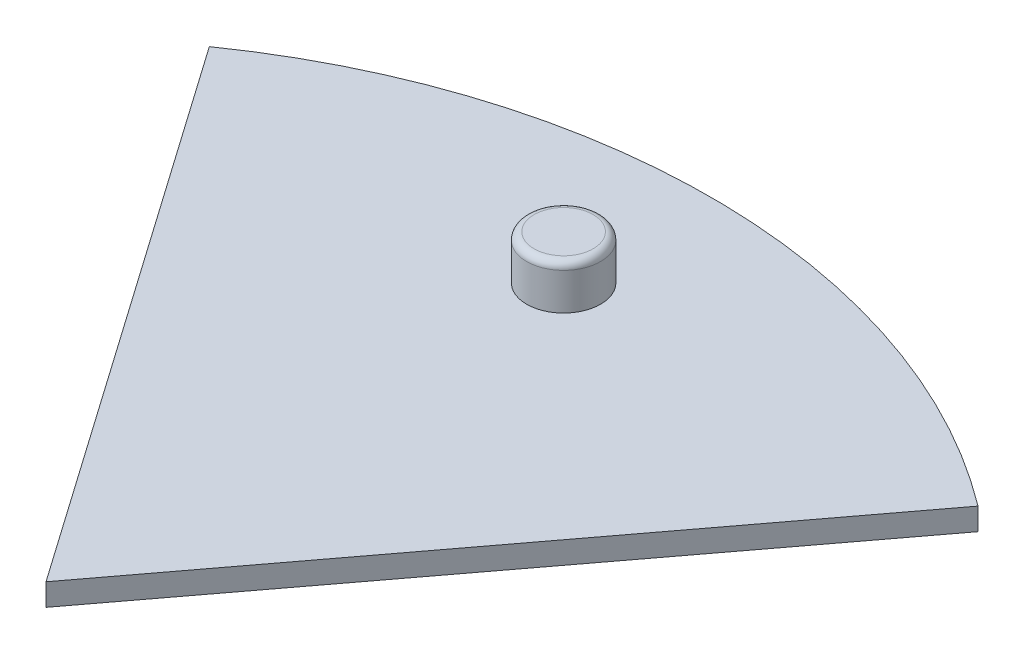
ISO-10303-21;
HEADER;
FILE_DESCRIPTION(('STEP AP214'),'2;1');
FILE_NAME('part.step','',(''),(''),'','','');
FILE_SCHEMA(('AUTOMOTIVE_DESIGN { 1 0 10303 214 1 1 1 1 }'));
ENDSEC;
DATA;
#1=APPLICATION_CONTEXT('core data for automotive mechanical design processes');
#2=APPLICATION_PROTOCOL_DEFINITION('international standard','automotive_design',2000,#1);
#3=PRODUCT_CONTEXT('',#1,'mechanical');
#4=PRODUCT('Part','Part','',(#3));
#5=PRODUCT_RELATED_PRODUCT_CATEGORY('part','',(#4));
#6=PRODUCT_DEFINITION_FORMATION('','',#4);
#7=PRODUCT_DEFINITION_CONTEXT('part definition',#1,'design');
#8=PRODUCT_DEFINITION('design','',#6,#7);
#9=PRODUCT_DEFINITION_SHAPE('','',#8);
#10=(LENGTH_UNIT() NAMED_UNIT(*) SI_UNIT(.MILLI.,.METRE.));
#11=(NAMED_UNIT(*) PLANE_ANGLE_UNIT() SI_UNIT($,.RADIAN.));
#12=(NAMED_UNIT(*) SI_UNIT($,.STERADIAN.) SOLID_ANGLE_UNIT());
#13=UNCERTAINTY_MEASURE_WITH_UNIT(LENGTH_MEASURE(1.E-05),#10,'distance_accuracy_value','');
#14=(GEOMETRIC_REPRESENTATION_CONTEXT(3) GLOBAL_UNCERTAINTY_ASSIGNED_CONTEXT((#13)) GLOBAL_UNIT_ASSIGNED_CONTEXT((#10,
#11,#12)) REPRESENTATION_CONTEXT('',''));
#15=CARTESIAN_POINT('',(0.,0.,0.));
#16=DIRECTION('',(0.,0.,1.));
#17=DIRECTION('',(1.,0.,0.));
#18=AXIS2_PLACEMENT_3D('',#15,#16,#17);
#19=CARTESIAN_POINT('',(0.,0.,0.));
#20=DIRECTION('',(0.,1.,0.));
#21=DIRECTION('',(0.,0.,1.));
#22=AXIS2_PLACEMENT_3D('',#19,#20,#21);
#23=PLANE('',#22);
#24=DIRECTION('',(0.601725535769377,0.,-0.798702935767145));
#25=VECTOR('',#24,1.);
#26=CARTESIAN_POINT('',(0.,0.,0.));
#27=LINE('',#26,#25);
#28=CARTESIAN_POINT('',(0.,0.,0.));
#29=VERTEX_POINT('',#28);
#30=CARTESIAN_POINT('',(27.077649109622,0.,-35.9416321095215));
#31=VERTEX_POINT('',#30);
#32=EDGE_CURVE('E138',#29,#31,#27,.T.);
#33=ORIENTED_EDGE('',*,*,#32,.F.);
#34=DIRECTION('',(-0.5736682151433,0.,-0.819087772423872));
#35=VECTOR('',#34,1.);
#36=CARTESIAN_POINT('',(0.,0.,0.));
#37=LINE('',#36,#35);
#38=CARTESIAN_POINT('',(-25.8150696814485,0.,-36.8589497590742));
#39=VERTEX_POINT('',#38);
#40=EDGE_CURVE('E151',#29,#39,#37,.T.);
#41=ORIENTED_EDGE('',*,*,#40,.T.);
#42=CARTESIAN_POINT('',(0.,0.,0.));
#43=DIRECTION('',(0.,1.,0.));
#44=DIRECTION('',(0.,0.,1.));
#45=AXIS2_PLACEMENT_3D('',#42,#43,#44);
#46=CIRCLE('',#45,45.);
#47=EDGE_CURVE('E142',#31,#39,#46,.T.);
#48=ORIENTED_EDGE('',*,*,#47,.F.);
#49=EDGE_LOOP('',(#33,#41,#48));
#50=FACE_BOUND('',#49,.T.);
#51=CARTESIAN_POINT('',(0.,0.,-35.));
#52=DIRECTION('',(0.,-1.,0.));
#53=DIRECTION('',(0.,0.,-1.));
#54=AXIS2_PLACEMENT_3D('',#51,#52,#53);
#55=CIRCLE('',#54,0.625000000000001);
#56=CARTESIAN_POINT('',(0.,0.,-34.375));
#57=VERTEX_POINT('',#56);
#58=CARTESIAN_POINT('',(0.,0.,-35.625));
#59=VERTEX_POINT('',#58);
#60=EDGE_CURVE('E135',#57,#59,#55,.T.);
#61=ORIENTED_EDGE('',*,*,#60,.F.);
#62=DIRECTION('',(1.,0.,0.));
#63=VECTOR('',#62,1.);
#64=CARTESIAN_POINT('',(0.,0.,-34.375));
#65=LINE('',#64,#63);
#66=CARTESIAN_POINT('',(10.,0.,-34.375));
#67=VERTEX_POINT('',#66);
#68=EDGE_CURVE('E131',#57,#67,#65,.T.);
#69=ORIENTED_EDGE('',*,*,#68,.T.);
#70=CARTESIAN_POINT('',(10.,0.,-35.));
#71=DIRECTION('',(0.,-1.,0.));
#72=DIRECTION('',(0.,0.,-1.));
#73=AXIS2_PLACEMENT_3D('',#70,#71,#72);
#74=CIRCLE('',#73,0.625000000000001);
#75=CARTESIAN_POINT('',(10.,0.,-35.625));
#76=VERTEX_POINT('',#75);
#77=EDGE_CURVE('E57',#76,#67,#74,.T.);
#78=ORIENTED_EDGE('',*,*,#77,.F.);
#79=DIRECTION('',(1.,0.,0.));
#80=VECTOR('',#79,1.);
#81=CARTESIAN_POINT('',(0.,0.,-35.625));
#82=LINE('',#81,#80);
#83=EDGE_CURVE('E218',#59,#76,#82,.T.);
#84=ORIENTED_EDGE('',*,*,#83,.F.);
#85=EDGE_LOOP('',(#61,#69,#78,#84));
#86=FACE_BOUND('',#85,.T.);
#87=ADVANCED_FACE('F41',(#50,#86),#23,.F.);
#88=CARTESIAN_POINT('',(0.,1.5,0.));
#89=DIRECTION('',(-0.798702935767145,0.,-0.601725535769377));
#90=DIRECTION('',(-0.601725535769377,0.,0.798702935767145));
#91=AXIS2_PLACEMENT_3D('',#88,#89,#90);
#92=PLANE('',#91);
#93=ORIENTED_EDGE('',*,*,#32,.T.);
#94=DIRECTION('',(0.,-1.,0.));
#95=VECTOR('',#94,1.);
#96=CARTESIAN_POINT('',(27.077649109622,1.5,-35.9416321095215));
#97=LINE('',#96,#95);
#98=CARTESIAN_POINT('',(27.077649109622,1.5,-35.9416321095215));
#99=VERTEX_POINT('',#98);
#100=EDGE_CURVE('E168',#99,#31,#97,.T.);
#101=ORIENTED_EDGE('',*,*,#100,.F.);
#102=DIRECTION('',(0.601725535769377,0.,-0.798702935767145));
#103=VECTOR('',#102,1.);
#104=CARTESIAN_POINT('',(0.,1.5,0.));
#105=LINE('',#104,#103);
#106=CARTESIAN_POINT('',(0.,1.5,0.));
#107=VERTEX_POINT('',#106);
#108=EDGE_CURVE('E148',#107,#99,#105,.T.);
#109=ORIENTED_EDGE('',*,*,#108,.F.);
#110=DIRECTION('',(0.,-1.,0.));
#111=VECTOR('',#110,1.);
#112=CARTESIAN_POINT('',(0.,1.5,0.));
#113=LINE('',#112,#111);
#114=EDGE_CURVE('E66',#107,#29,#113,.T.);
#115=ORIENTED_EDGE('',*,*,#114,.T.);
#116=EDGE_LOOP('',(#93,#101,#109,#115));
#117=FACE_BOUND('',#116,.T.);
#118=ADVANCED_FACE('F185',(#117),#92,.F.);
#119=CARTESIAN_POINT('',(0.,1.5,0.));
#120=DIRECTION('',(0.,-1.,0.));
#121=DIRECTION('',(0.,0.,-1.));
#122=AXIS2_PLACEMENT_3D('',#119,#120,#121);
#123=CYLINDRICAL_SURFACE('',#122,45.);
#124=ORIENTED_EDGE('',*,*,#47,.T.);
#125=DIRECTION('',(0.,-1.,0.));
#126=VECTOR('',#125,1.);
#127=CARTESIAN_POINT('',(-25.8150696814485,1.5,-36.8589497590742));
#128=LINE('',#127,#126);
#129=CARTESIAN_POINT('',(-25.8150696814485,1.5,-36.8589497590742));
#130=VERTEX_POINT('',#129);
#131=EDGE_CURVE('E165',#130,#39,#128,.T.);
#132=ORIENTED_EDGE('',*,*,#131,.F.);
#133=CARTESIAN_POINT('',(0.,1.5,0.));
#134=DIRECTION('',(0.,1.,0.));
#135=DIRECTION('',(0.,0.,1.));
#136=AXIS2_PLACEMENT_3D('',#133,#134,#135);
#137=CIRCLE('',#136,45.);
#138=EDGE_CURVE('E87',#99,#130,#137,.T.);
#139=ORIENTED_EDGE('',*,*,#138,.F.);
#140=ORIENTED_EDGE('',*,*,#100,.T.);
#141=EDGE_LOOP('',(#124,#132,#139,#140));
#142=FACE_BOUND('',#141,.T.);
#143=ADVANCED_FACE('F191',(#142),#123,.T.);
#144=CARTESIAN_POINT('',(0.,1.5,0.));
#145=DIRECTION('',(-0.819087772423872,0.,0.5736682151433));
#146=DIRECTION('',(0.5736682151433,0.,0.819087772423872));
#147=AXIS2_PLACEMENT_3D('',#144,#145,#146);
#148=PLANE('',#147);
#149=ORIENTED_EDGE('',*,*,#40,.F.);
#150=ORIENTED_EDGE('',*,*,#114,.F.);
#151=DIRECTION('',(-0.5736682151433,0.,-0.819087772423872));
#152=VECTOR('',#151,1.);
#153=CARTESIAN_POINT('',(0.,1.5,0.));
#154=LINE('',#153,#152);
#155=EDGE_CURVE('E154',#107,#130,#154,.T.);
#156=ORIENTED_EDGE('',*,*,#155,.T.);
#157=ORIENTED_EDGE('',*,*,#131,.T.);
#158=EDGE_LOOP('',(#149,#150,#156,#157));
#159=FACE_BOUND('',#158,.T.);
#160=ADVANCED_FACE('F197',(#159),#148,.T.);
#161=CARTESIAN_POINT('',(0.,1.5,0.));
#162=DIRECTION('',(0.,1.,0.));
#163=DIRECTION('',(0.,0.,1.));
#164=AXIS2_PLACEMENT_3D('',#161,#162,#163);
#165=PLANE('',#164);
#166=CARTESIAN_POINT('',(0.,1.5,-35.));
#167=DIRECTION('',(0.,1.,0.));
#168=DIRECTION('',(0.,0.,1.));
#169=AXIS2_PLACEMENT_3D('',#166,#167,#168);
#170=CIRCLE('',#169,2.5);
#171=CARTESIAN_POINT('',(0.,1.5,-32.5));
#172=VERTEX_POINT('',#171);
#173=EDGE_CURVE('E213',#172,#172,#170,.T.);
#174=ORIENTED_EDGE('',*,*,#173,.F.);
#175=EDGE_LOOP('',(#174));
#176=FACE_BOUND('',#175,.T.);
#177=ORIENTED_EDGE('',*,*,#108,.T.);
#178=ORIENTED_EDGE('',*,*,#138,.T.);
#179=ORIENTED_EDGE('',*,*,#155,.F.);
#180=EDGE_LOOP('',(#177,#178,#179));
#181=FACE_BOUND('',#180,.T.);
#182=ADVANCED_FACE('F195',(#176,#181),#165,.T.);
#183=CARTESIAN_POINT('',(0.,-1.5,-35.));
#184=DIRECTION('',(0.,1.,0.));
#185=DIRECTION('',(0.,0.,1.));
#186=AXIS2_PLACEMENT_3D('',#183,#184,#185);
#187=CYLINDRICAL_SURFACE('',#186,0.625000000000001);
#188=ORIENTED_EDGE('',*,*,#60,.T.);
#189=DIRECTION('',(0.,1.,0.));
#190=VECTOR('',#189,1.);
#191=CARTESIAN_POINT('',(0.,-1.5,-35.625));
#192=LINE('',#191,#190);
#193=CARTESIAN_POINT('',(0.,-1.5,-35.625));
#194=VERTEX_POINT('',#193);
#195=EDGE_CURVE('E115',#194,#59,#192,.T.);
#196=ORIENTED_EDGE('',*,*,#195,.F.);
#197=CARTESIAN_POINT('',(0.,-1.5,-35.));
#198=DIRECTION('',(0.,-1.,0.));
#199=DIRECTION('',(0.,0.,-1.));
#200=AXIS2_PLACEMENT_3D('',#197,#198,#199);
#201=CIRCLE('',#200,0.625000000000001);
#202=CARTESIAN_POINT('',(0.,-1.5,-34.375));
#203=VERTEX_POINT('',#202);
#204=EDGE_CURVE('E122',#203,#194,#201,.T.);
#205=ORIENTED_EDGE('',*,*,#204,.F.);
#206=DIRECTION('',(0.,1.,0.));
#207=VECTOR('',#206,1.);
#208=CARTESIAN_POINT('',(0.,-1.5,-34.375));
#209=LINE('',#208,#207);
#210=EDGE_CURVE('E224',#203,#57,#209,.T.);
#211=ORIENTED_EDGE('',*,*,#210,.T.);
#212=EDGE_LOOP('',(#188,#196,#205,#211));
#213=FACE_BOUND('',#212,.T.);
#214=ADVANCED_FACE('F133',(#213),#187,.T.);
#215=CARTESIAN_POINT('',(0.,-1.5,-35.625));
#216=DIRECTION('',(0.,0.,1.));
#217=DIRECTION('',(1.,0.,0.));
#218=AXIS2_PLACEMENT_3D('',#215,#216,#217);
#219=PLANE('',#218);
#220=ORIENTED_EDGE('',*,*,#83,.T.);
#221=DIRECTION('',(0.,1.,0.));
#222=VECTOR('',#221,1.);
#223=CARTESIAN_POINT('',(10.,-1.5,-35.625));
#224=LINE('',#223,#222);
#225=CARTESIAN_POINT('',(10.,-1.5,-35.625));
#226=VERTEX_POINT('',#225);
#227=EDGE_CURVE('E117',#226,#76,#224,.T.);
#228=ORIENTED_EDGE('',*,*,#227,.F.);
#229=DIRECTION('',(1.,0.,0.));
#230=VECTOR('',#229,1.);
#231=CARTESIAN_POINT('',(0.,-1.5,-35.625));
#232=LINE('',#231,#230);
#233=EDGE_CURVE('E111',#194,#226,#232,.T.);
#234=ORIENTED_EDGE('',*,*,#233,.F.);
#235=ORIENTED_EDGE('',*,*,#195,.T.);
#236=EDGE_LOOP('',(#220,#228,#234,#235));
#237=FACE_BOUND('',#236,.T.);
#238=ADVANCED_FACE('F113',(#237),#219,.F.);
#239=CARTESIAN_POINT('',(10.,-1.5,-35.));
#240=DIRECTION('',(0.,1.,0.));
#241=DIRECTION('',(0.,0.,1.));
#242=AXIS2_PLACEMENT_3D('',#239,#240,#241);
#243=CYLINDRICAL_SURFACE('',#242,0.625000000000001);
#244=ORIENTED_EDGE('',*,*,#77,.T.);
#245=DIRECTION('',(0.,1.,0.));
#246=VECTOR('',#245,1.);
#247=CARTESIAN_POINT('',(10.,-1.5,-34.375));
#248=LINE('',#247,#246);
#249=CARTESIAN_POINT('',(10.,-1.5,-34.375));
#250=VERTEX_POINT('',#249);
#251=EDGE_CURVE('E144',#250,#67,#248,.T.);
#252=ORIENTED_EDGE('',*,*,#251,.F.);
#253=CARTESIAN_POINT('',(10.,-1.5,-35.));
#254=DIRECTION('',(0.,-1.,0.));
#255=DIRECTION('',(0.,0.,-1.));
#256=AXIS2_PLACEMENT_3D('',#253,#254,#255);
#257=CIRCLE('',#256,0.625000000000001);
#258=EDGE_CURVE('E121',#226,#250,#257,.T.);
#259=ORIENTED_EDGE('',*,*,#258,.F.);
#260=ORIENTED_EDGE('',*,*,#227,.T.);
#261=EDGE_LOOP('',(#244,#252,#259,#260));
#262=FACE_BOUND('',#261,.T.);
#263=ADVANCED_FACE('F238',(#262),#243,.T.);
#264=CARTESIAN_POINT('',(0.,-1.5,-34.375));
#265=DIRECTION('',(0.,0.,1.));
#266=DIRECTION('',(1.,0.,0.));
#267=AXIS2_PLACEMENT_3D('',#264,#265,#266);
#268=PLANE('',#267);
#269=ORIENTED_EDGE('',*,*,#68,.F.);
#270=ORIENTED_EDGE('',*,*,#210,.F.);
#271=DIRECTION('',(1.,0.,0.));
#272=VECTOR('',#271,1.);
#273=CARTESIAN_POINT('',(0.,-1.5,-34.375));
#274=LINE('',#273,#272);
#275=EDGE_CURVE('E128',#203,#250,#274,.T.);
#276=ORIENTED_EDGE('',*,*,#275,.T.);
#277=ORIENTED_EDGE('',*,*,#251,.T.);
#278=EDGE_LOOP('',(#269,#270,#276,#277));
#279=FACE_BOUND('',#278,.T.);
#280=ADVANCED_FACE('F237',(#279),#268,.T.);
#281=CARTESIAN_POINT('',(0.,-1.5,-35.));
#282=DIRECTION('',(0.,-1.,0.));
#283=DIRECTION('',(0.,0.,-1.));
#284=AXIS2_PLACEMENT_3D('',#281,#282,#283);
#285=PLANE('',#284);
#286=ORIENTED_EDGE('',*,*,#204,.T.);
#287=ORIENTED_EDGE('',*,*,#233,.T.);
#288=ORIENTED_EDGE('',*,*,#258,.T.);
#289=ORIENTED_EDGE('',*,*,#275,.F.);
#290=EDGE_LOOP('',(#286,#287,#288,#289));
#291=FACE_BOUND('',#290,.T.);
#292=ADVANCED_FACE('F126',(#291),#285,.T.);
#293=CARTESIAN_POINT('',(0.,4.5,-35.));
#294=DIRECTION('',(0.,-1.,0.));
#295=DIRECTION('',(0.,0.,-1.));
#296=AXIS2_PLACEMENT_3D('',#293,#294,#295);
#297=CYLINDRICAL_SURFACE('',#296,2.5);
#298=CARTESIAN_POINT('',(0.,4.,-35.));
#299=DIRECTION('',(0.,1.,0.));
#300=DIRECTION('',(0.,0.,1.));
#301=AXIS2_PLACEMENT_3D('',#298,#299,#300);
#302=CIRCLE('',#301,2.5);
#303=CARTESIAN_POINT('',(0.,4.,-32.5));
#304=VERTEX_POINT('',#303);
#305=EDGE_CURVE('E11',#304,#304,#302,.F.);
#306=ORIENTED_EDGE('',*,*,#305,.T.);
#307=EDGE_LOOP('',(#306));
#308=FACE_BOUND('',#307,.T.);
#309=ORIENTED_EDGE('',*,*,#173,.T.);
#310=EDGE_LOOP('',(#309));
#311=FACE_BOUND('',#310,.T.);
#312=ADVANCED_FACE('F181',(#308,#311),#297,.T.);
#313=CARTESIAN_POINT('',(0.,4.5,0.));
#314=DIRECTION('',(0.,1.,0.));
#315=DIRECTION('',(0.,0.,1.));
#316=AXIS2_PLACEMENT_3D('',#313,#314,#315);
#317=PLANE('',#316);
#318=CARTESIAN_POINT('',(0.,4.5,-35.));
#319=DIRECTION('',(0.,1.,0.));
#320=DIRECTION('',(0.,0.,1.));
#321=AXIS2_PLACEMENT_3D('',#318,#319,#320);
#322=CIRCLE('',#321,2.);
#323=CARTESIAN_POINT('',(0.,4.5,-33.));
#324=VERTEX_POINT('',#323);
#325=EDGE_CURVE('E50',#324,#324,#322,.T.);
#326=ORIENTED_EDGE('',*,*,#325,.T.);
#327=EDGE_LOOP('',(#326));
#328=FACE_BOUND('',#327,.T.);
#329=ADVANCED_FACE('F174',(#328),#317,.T.);
#330=CARTESIAN_POINT('',(0.,4.,-35.));
#331=DIRECTION('',(0.,1.,0.));
#332=DIRECTION('',(0.,0.,1.));
#333=AXIS2_PLACEMENT_3D('',#330,#331,#332);
#334=TOROIDAL_SURFACE('',#333,2.,0.5);
#335=ORIENTED_EDGE('',*,*,#305,.F.);
#336=EDGE_LOOP('',(#335));
#337=FACE_BOUND('',#336,.T.);
#338=ORIENTED_EDGE('',*,*,#325,.F.);
#339=EDGE_LOOP('',(#338));
#340=FACE_BOUND('',#339,.T.);
#341=ADVANCED_FACE('F43',(#337,#340),#334,.T.);
#342=CLOSED_SHELL('',(#87,#118,#143,#160,#182,#214,#238,#263,#280,#292,#312,#329,#341));
#343=MANIFOLD_SOLID_BREP('B2',#342);
#344=ADVANCED_BREP_SHAPE_REPRESENTATION('',(#18,#343),#14);
#345=SHAPE_DEFINITION_REPRESENTATION(#9,#344);
ENDSEC;
END-ISO-10303-21;
